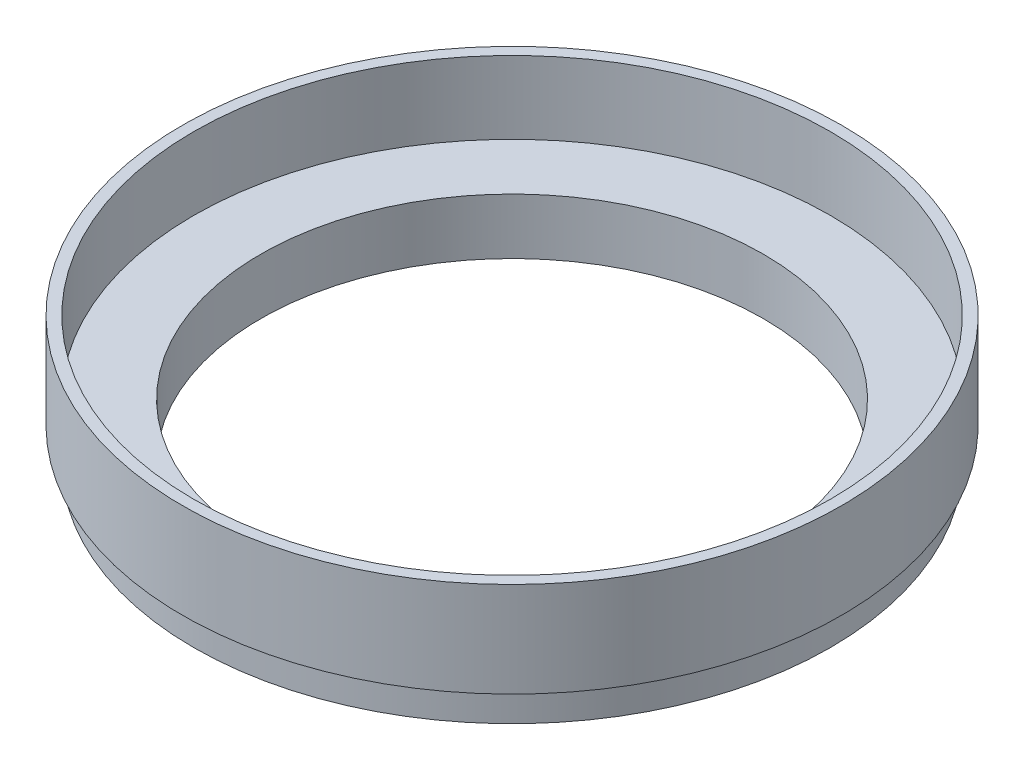
ISO-10303-21;
HEADER;
FILE_DESCRIPTION(('STEP AP214'),'2;1');
FILE_NAME('part.step','',(''),(''),'','','');
FILE_SCHEMA(('AUTOMOTIVE_DESIGN { 1 0 10303 214 1 1 1 1 }'));
ENDSEC;
DATA;
#1=APPLICATION_CONTEXT('core data for automotive mechanical design processes');
#2=APPLICATION_PROTOCOL_DEFINITION('international standard','automotive_design',2000,#1);
#3=PRODUCT_CONTEXT('',#1,'mechanical');
#4=PRODUCT('Part','Part','',(#3));
#5=PRODUCT_RELATED_PRODUCT_CATEGORY('part','',(#4));
#6=PRODUCT_DEFINITION_FORMATION('','',#4);
#7=PRODUCT_DEFINITION_CONTEXT('part definition',#1,'design');
#8=PRODUCT_DEFINITION('design','',#6,#7);
#9=PRODUCT_DEFINITION_SHAPE('','',#8);
#10=(LENGTH_UNIT() NAMED_UNIT(*) SI_UNIT(.MILLI.,.METRE.));
#11=(NAMED_UNIT(*) PLANE_ANGLE_UNIT() SI_UNIT($,.RADIAN.));
#12=(NAMED_UNIT(*) SI_UNIT($,.STERADIAN.) SOLID_ANGLE_UNIT());
#13=UNCERTAINTY_MEASURE_WITH_UNIT(LENGTH_MEASURE(1.E-05),#10,'distance_accuracy_value','');
#14=(GEOMETRIC_REPRESENTATION_CONTEXT(3) GLOBAL_UNCERTAINTY_ASSIGNED_CONTEXT((#13)) GLOBAL_UNIT_ASSIGNED_CONTEXT((#10,
#11,#12)) REPRESENTATION_CONTEXT('',''));
#15=CARTESIAN_POINT('',(0.,0.,0.));
#16=DIRECTION('',(0.,0.,1.));
#17=DIRECTION('',(1.,0.,0.));
#18=AXIS2_PLACEMENT_3D('',#15,#16,#17);
#19=CARTESIAN_POINT('',(22.5,0.,0.));
#20=DIRECTION('',(0.,-1.,0.));
#21=DIRECTION('',(0.,0.,-1.));
#22=AXIS2_PLACEMENT_3D('',#19,#20,#21);
#23=PLANE('',#22);
#24=CARTESIAN_POINT('',(0.,0.,0.));
#25=DIRECTION('',(0.,-1.,0.));
#26=DIRECTION('',(0.,0.,-1.));
#27=AXIS2_PLACEMENT_3D('',#24,#25,#26);
#28=CIRCLE('',#27,24.5);
#29=CARTESIAN_POINT('',(0.,0.,-24.5));
#30=VERTEX_POINT('',#29);
#31=EDGE_CURVE('E10',#30,#30,#28,.T.);
#32=ORIENTED_EDGE('',*,*,#31,.T.);
#33=EDGE_LOOP('',(#32));
#34=FACE_BOUND('',#33,.T.);
#35=CARTESIAN_POINT('',(0.,0.,0.));
#36=DIRECTION('',(0.,-1.,0.));
#37=DIRECTION('',(0.,0.,-1.));
#38=AXIS2_PLACEMENT_3D('',#35,#36,#37);
#39=CIRCLE('',#38,22.5);
#40=CARTESIAN_POINT('',(0.,0.,-22.5));
#41=VERTEX_POINT('',#40);
#42=EDGE_CURVE('E73',#41,#41,#39,.T.);
#43=ORIENTED_EDGE('',*,*,#42,.F.);
#44=EDGE_LOOP('',(#43));
#45=FACE_BOUND('',#44,.T.);
#46=ADVANCED_FACE('F33',(#34,#45),#23,.T.);
#47=CARTESIAN_POINT('',(0.,0.,0.));
#48=DIRECTION('',(0.,-1.,0.));
#49=DIRECTION('',(0.,0.,-1.));
#50=AXIS2_PLACEMENT_3D('',#47,#48,#49);
#51=CYLINDRICAL_SURFACE('',#50,24.5);
#52=CARTESIAN_POINT('',(0.,2.,0.));
#53=DIRECTION('',(0.,-1.,0.));
#54=DIRECTION('',(0.,0.,-1.));
#55=AXIS2_PLACEMENT_3D('',#52,#53,#54);
#56=CIRCLE('',#55,24.5);
#57=CARTESIAN_POINT('',(0.,2.,-24.5));
#58=VERTEX_POINT('',#57);
#59=EDGE_CURVE('E39',#58,#58,#56,.T.);
#60=ORIENTED_EDGE('',*,*,#59,.T.);
#61=EDGE_LOOP('',(#60));
#62=FACE_BOUND('',#61,.T.);
#63=ORIENTED_EDGE('',*,*,#31,.F.);
#64=EDGE_LOOP('',(#63));
#65=FACE_BOUND('',#64,.T.);
#66=ADVANCED_FACE('F81',(#62,#65),#51,.T.);
#67=CARTESIAN_POINT('',(24.5,2.,0.));
#68=DIRECTION('',(0.,-1.,0.));
#69=DIRECTION('',(0.,0.,-1.));
#70=AXIS2_PLACEMENT_3D('',#67,#68,#69);
#71=PLANE('',#70);
#72=CARTESIAN_POINT('',(0.,2.,0.));
#73=DIRECTION('',(0.,-1.,0.));
#74=DIRECTION('',(0.,0.,-1.));
#75=AXIS2_PLACEMENT_3D('',#72,#73,#74);
#76=CIRCLE('',#75,26.5);
#77=CARTESIAN_POINT('',(0.,2.,-26.5));
#78=VERTEX_POINT('',#77);
#79=EDGE_CURVE('E43',#78,#78,#76,.T.);
#80=ORIENTED_EDGE('',*,*,#79,.T.);
#81=EDGE_LOOP('',(#80));
#82=FACE_BOUND('',#81,.T.);
#83=ORIENTED_EDGE('',*,*,#59,.F.);
#84=EDGE_LOOP('',(#83));
#85=FACE_BOUND('',#84,.T.);
#86=ADVANCED_FACE('F85',(#82,#85),#71,.T.);
#87=CARTESIAN_POINT('',(0.,0.,0.));
#88=DIRECTION('',(0.,-1.,0.));
#89=DIRECTION('',(0.,0.,-1.));
#90=AXIS2_PLACEMENT_3D('',#87,#88,#89);
#91=CYLINDRICAL_SURFACE('',#90,26.5);
#92=CARTESIAN_POINT('',(0.,0.,0.));
#93=DIRECTION('',(0.,-1.,0.));
#94=DIRECTION('',(0.,0.,-1.));
#95=AXIS2_PLACEMENT_3D('',#92,#93,#94);
#96=CIRCLE('',#95,26.5);
#97=CARTESIAN_POINT('',(0.,0.,-26.5));
#98=VERTEX_POINT('',#97);
#99=EDGE_CURVE('E47',#98,#98,#96,.T.);
#100=ORIENTED_EDGE('',*,*,#99,.T.);
#101=EDGE_LOOP('',(#100));
#102=FACE_BOUND('',#101,.T.);
#103=ORIENTED_EDGE('',*,*,#79,.F.);
#104=EDGE_LOOP('',(#103));
#105=FACE_BOUND('',#104,.T.);
#106=ADVANCED_FACE('F89',(#102,#105),#91,.F.);
#107=CARTESIAN_POINT('',(26.5,0.,0.));
#108=DIRECTION('',(0.,-1.,0.));
#109=DIRECTION('',(0.,0.,-1.));
#110=AXIS2_PLACEMENT_3D('',#107,#108,#109);
#111=PLANE('',#110);
#112=CARTESIAN_POINT('',(0.,0.,0.));
#113=DIRECTION('',(0.,-1.,0.));
#114=DIRECTION('',(0.,0.,-1.));
#115=AXIS2_PLACEMENT_3D('',#112,#113,#114);
#116=CIRCLE('',#115,28.5);
#117=CARTESIAN_POINT('',(0.,0.,-28.5));
#118=VERTEX_POINT('',#117);
#119=EDGE_CURVE('E52',#118,#118,#116,.T.);
#120=ORIENTED_EDGE('',*,*,#119,.T.);
#121=EDGE_LOOP('',(#120));
#122=FACE_BOUND('',#121,.T.);
#123=ORIENTED_EDGE('',*,*,#99,.F.);
#124=EDGE_LOOP('',(#123));
#125=FACE_BOUND('',#124,.T.);
#126=ADVANCED_FACE('F96',(#122,#125),#111,.T.);
#127=CARTESIAN_POINT('',(0.,0.,0.));
#128=DIRECTION('',(0.,-1.,0.));
#129=DIRECTION('',(0.,0.,-1.));
#130=AXIS2_PLACEMENT_3D('',#127,#128,#129);
#131=CYLINDRICAL_SURFACE('',#130,28.5);
#132=CARTESIAN_POINT('',(0.,3.,0.));
#133=DIRECTION('',(0.,-1.,0.));
#134=DIRECTION('',(0.,0.,-1.));
#135=AXIS2_PLACEMENT_3D('',#132,#133,#134);
#136=CIRCLE('',#135,28.5);
#137=CARTESIAN_POINT('',(0.,3.,-28.5));
#138=VERTEX_POINT('',#137);
#139=EDGE_CURVE('E55',#138,#138,#136,.T.);
#140=ORIENTED_EDGE('',*,*,#139,.T.);
#141=EDGE_LOOP('',(#140));
#142=FACE_BOUND('',#141,.T.);
#143=ORIENTED_EDGE('',*,*,#119,.F.);
#144=EDGE_LOOP('',(#143));
#145=FACE_BOUND('',#144,.T.);
#146=ADVANCED_FACE('F100',(#142,#145),#131,.T.);
#147=CARTESIAN_POINT('',(28.5,3.,0.));
#148=DIRECTION('',(0.,-1.,0.));
#149=DIRECTION('',(0.,0.,-1.));
#150=AXIS2_PLACEMENT_3D('',#147,#148,#149);
#151=PLANE('',#150);
#152=CARTESIAN_POINT('',(0.,3.,0.));
#153=DIRECTION('',(0.,-1.,0.));
#154=DIRECTION('',(0.,0.,-1.));
#155=AXIS2_PLACEMENT_3D('',#152,#153,#154);
#156=CIRCLE('',#155,29.5);
#157=CARTESIAN_POINT('',(0.,3.,-29.5));
#158=VERTEX_POINT('',#157);
#159=EDGE_CURVE('E58',#158,#158,#156,.T.);
#160=ORIENTED_EDGE('',*,*,#159,.T.);
#161=EDGE_LOOP('',(#160));
#162=FACE_BOUND('',#161,.T.);
#163=ORIENTED_EDGE('',*,*,#139,.F.);
#164=EDGE_LOOP('',(#163));
#165=FACE_BOUND('',#164,.T.);
#166=ADVANCED_FACE('F104',(#162,#165),#151,.T.);
#167=CARTESIAN_POINT('',(0.,0.,0.));
#168=DIRECTION('',(0.,-1.,0.));
#169=DIRECTION('',(0.,0.,-1.));
#170=AXIS2_PLACEMENT_3D('',#167,#168,#169);
#171=CYLINDRICAL_SURFACE('',#170,29.5);
#172=CARTESIAN_POINT('',(0.,11.5,0.));
#173=DIRECTION('',(0.,-1.,0.));
#174=DIRECTION('',(0.,0.,-1.));
#175=AXIS2_PLACEMENT_3D('',#172,#173,#174);
#176=CIRCLE('',#175,29.5);
#177=CARTESIAN_POINT('',(0.,11.5,-29.5));
#178=VERTEX_POINT('',#177);
#179=EDGE_CURVE('E61',#178,#178,#176,.T.);
#180=ORIENTED_EDGE('',*,*,#179,.T.);
#181=EDGE_LOOP('',(#180));
#182=FACE_BOUND('',#181,.T.);
#183=ORIENTED_EDGE('',*,*,#159,.F.);
#184=EDGE_LOOP('',(#183));
#185=FACE_BOUND('',#184,.T.);
#186=ADVANCED_FACE('F108',(#182,#185),#171,.T.);
#187=CARTESIAN_POINT('',(28.5,11.5,0.));
#188=DIRECTION('',(0.,1.,0.));
#189=DIRECTION('',(0.,0.,1.));
#190=AXIS2_PLACEMENT_3D('',#187,#188,#189);
#191=PLANE('',#190);
#192=CARTESIAN_POINT('',(0.,11.5,0.));
#193=DIRECTION('',(0.,-1.,0.));
#194=DIRECTION('',(0.,0.,-1.));
#195=AXIS2_PLACEMENT_3D('',#192,#193,#194);
#196=CIRCLE('',#195,28.5);
#197=CARTESIAN_POINT('',(0.,11.5,-28.5));
#198=VERTEX_POINT('',#197);
#199=EDGE_CURVE('E64',#198,#198,#196,.T.);
#200=ORIENTED_EDGE('',*,*,#199,.T.);
#201=EDGE_LOOP('',(#200));
#202=FACE_BOUND('',#201,.T.);
#203=ORIENTED_EDGE('',*,*,#179,.F.);
#204=EDGE_LOOP('',(#203));
#205=FACE_BOUND('',#204,.T.);
#206=ADVANCED_FACE('F112',(#202,#205),#191,.T.);
#207=CARTESIAN_POINT('',(0.,0.,0.));
#208=DIRECTION('',(0.,-1.,0.));
#209=DIRECTION('',(0.,0.,-1.));
#210=AXIS2_PLACEMENT_3D('',#207,#208,#209);
#211=CYLINDRICAL_SURFACE('',#210,28.5);
#212=CARTESIAN_POINT('',(0.,5.,0.));
#213=DIRECTION('',(0.,-1.,0.));
#214=DIRECTION('',(0.,0.,-1.));
#215=AXIS2_PLACEMENT_3D('',#212,#213,#214);
#216=CIRCLE('',#215,28.5);
#217=CARTESIAN_POINT('',(0.,5.,-28.5));
#218=VERTEX_POINT('',#217);
#219=EDGE_CURVE('E67',#218,#218,#216,.T.);
#220=ORIENTED_EDGE('',*,*,#219,.T.);
#221=EDGE_LOOP('',(#220));
#222=FACE_BOUND('',#221,.T.);
#223=ORIENTED_EDGE('',*,*,#199,.F.);
#224=EDGE_LOOP('',(#223));
#225=FACE_BOUND('',#224,.T.);
#226=ADVANCED_FACE('F116',(#222,#225),#211,.F.);
#227=CARTESIAN_POINT('',(28.5,5.,0.));
#228=DIRECTION('',(0.,1.,0.));
#229=DIRECTION('',(0.,0.,1.));
#230=AXIS2_PLACEMENT_3D('',#227,#228,#229);
#231=PLANE('',#230);
#232=CARTESIAN_POINT('',(0.,5.,0.));
#233=DIRECTION('',(0.,-1.,0.));
#234=DIRECTION('',(0.,0.,-1.));
#235=AXIS2_PLACEMENT_3D('',#232,#233,#234);
#236=CIRCLE('',#235,22.5);
#237=CARTESIAN_POINT('',(0.,5.,-22.5));
#238=VERTEX_POINT('',#237);
#239=EDGE_CURVE('E70',#238,#238,#236,.T.);
#240=ORIENTED_EDGE('',*,*,#239,.T.);
#241=EDGE_LOOP('',(#240));
#242=FACE_BOUND('',#241,.T.);
#243=ORIENTED_EDGE('',*,*,#219,.F.);
#244=EDGE_LOOP('',(#243));
#245=FACE_BOUND('',#244,.T.);
#246=ADVANCED_FACE('F120',(#242,#245),#231,.T.);
#247=CARTESIAN_POINT('',(0.,0.,0.));
#248=DIRECTION('',(0.,-1.,0.));
#249=DIRECTION('',(0.,0.,-1.));
#250=AXIS2_PLACEMENT_3D('',#247,#248,#249);
#251=CYLINDRICAL_SURFACE('',#250,22.5);
#252=ORIENTED_EDGE('',*,*,#42,.T.);
#253=EDGE_LOOP('',(#252));
#254=FACE_BOUND('',#253,.T.);
#255=ORIENTED_EDGE('',*,*,#239,.F.);
#256=EDGE_LOOP('',(#255));
#257=FACE_BOUND('',#256,.T.);
#258=ADVANCED_FACE('F77',(#254,#257),#251,.F.);
#259=CLOSED_SHELL('',(#46,#66,#86,#106,#126,#146,#166,#186,#206,#226,#246,#258));
#260=MANIFOLD_SOLID_BREP('B2',#259);
#261=ADVANCED_BREP_SHAPE_REPRESENTATION('',(#18,#260),#14);
#262=SHAPE_DEFINITION_REPRESENTATION(#9,#261);
ENDSEC;
END-ISO-10303-21;
